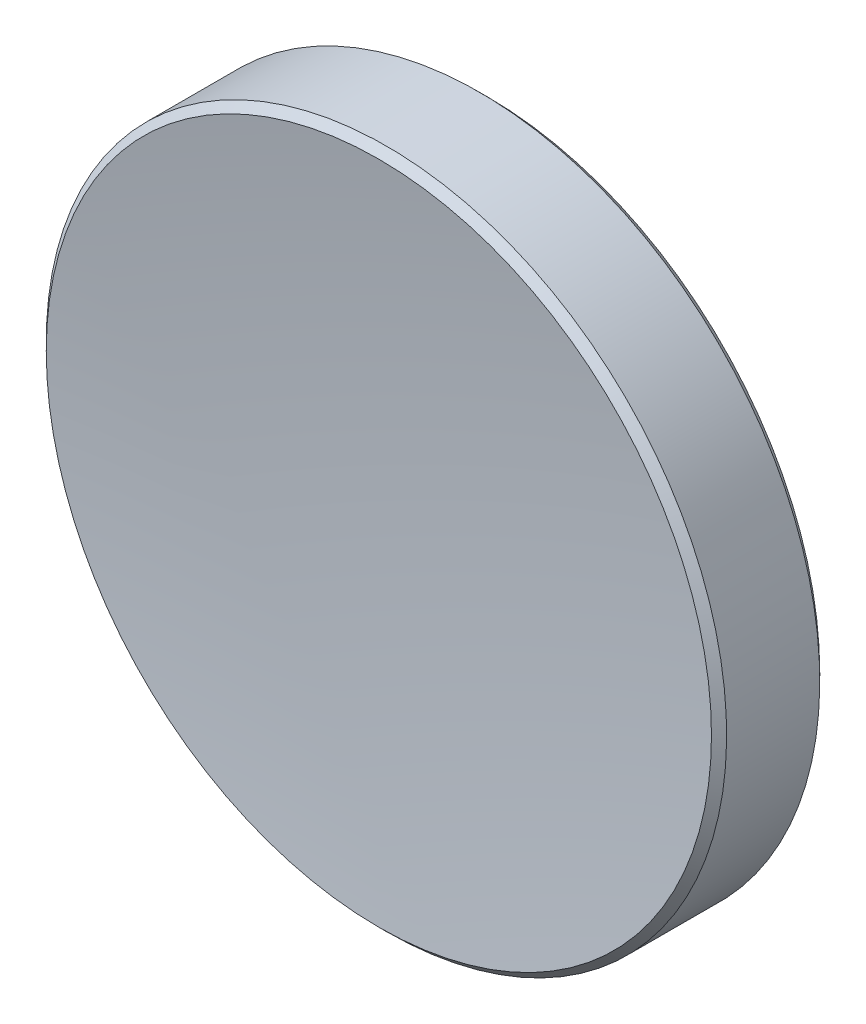
ISO-10303-21;
HEADER;
FILE_DESCRIPTION(('STEP AP214'),'2;1');
FILE_NAME('part.step','',(''),(''),'','','');
FILE_SCHEMA(('AUTOMOTIVE_DESIGN { 1 0 10303 214 1 1 1 1 }'));
ENDSEC;
DATA;
#1=APPLICATION_CONTEXT('core data for automotive mechanical design processes');
#2=APPLICATION_PROTOCOL_DEFINITION('international standard','automotive_design',2000,#1);
#3=PRODUCT_CONTEXT('',#1,'mechanical');
#4=PRODUCT('Part','Part','',(#3));
#5=PRODUCT_RELATED_PRODUCT_CATEGORY('part','',(#4));
#6=PRODUCT_DEFINITION_FORMATION('','',#4);
#7=PRODUCT_DEFINITION_CONTEXT('part definition',#1,'design');
#8=PRODUCT_DEFINITION('design','',#6,#7);
#9=PRODUCT_DEFINITION_SHAPE('','',#8);
#10=(LENGTH_UNIT() NAMED_UNIT(*) SI_UNIT(.MILLI.,.METRE.));
#11=(NAMED_UNIT(*) PLANE_ANGLE_UNIT() SI_UNIT($,.RADIAN.));
#12=(NAMED_UNIT(*) SI_UNIT($,.STERADIAN.) SOLID_ANGLE_UNIT());
#13=UNCERTAINTY_MEASURE_WITH_UNIT(LENGTH_MEASURE(1.E-05),#10,'distance_accuracy_value','');
#14=(GEOMETRIC_REPRESENTATION_CONTEXT(3) GLOBAL_UNCERTAINTY_ASSIGNED_CONTEXT((#13)) GLOBAL_UNIT_ASSIGNED_CONTEXT((#10,
#11,#12)) REPRESENTATION_CONTEXT('',''));
#15=CARTESIAN_POINT('',(0.,0.,0.));
#16=DIRECTION('',(0.,0.,1.));
#17=DIRECTION('',(1.,0.,0.));
#18=AXIS2_PLACEMENT_3D('',#15,#16,#17);
#19=CARTESIAN_POINT('',(0.,0.,54.0943324852001));
#20=DIRECTION('',(0.,0.,1.));
#21=DIRECTION('',(0.,1.,0.));
#22=AXIS2_PLACEMENT_3D('',#19,#20,#21);
#23=SPHERICAL_SURFACE('',#22,52.786);
#24=CARTESIAN_POINT('',(0.,0.,1.67472406216609));
#25=DIRECTION('',(0.,0.,1.));
#26=DIRECTION('',(0.,-1.,0.));
#27=AXIS2_PLACEMENT_3D('',#24,#25,#26);
#28=CIRCLE('',#27,6.20857864376269);
#29=CARTESIAN_POINT('',(0.,-6.20857864376269,1.67472406216608));
#30=VERTEX_POINT('',#29);
#31=EDGE_CURVE('E27',#30,#30,#28,.T.);
#32=ORIENTED_EDGE('',*,*,#31,.T.);
#33=EDGE_LOOP('',(#32));
#34=FACE_BOUND('',#33,.T.);
#35=ADVANCED_FACE('F13',(#34),#23,.F.);
#36=CARTESIAN_POINT('',(0.,0.,13.3083324852001));
#37=DIRECTION('',(0.,0.,1.));
#38=DIRECTION('',(0.,-1.,0.));
#39=AXIS2_PLACEMENT_3D('',#36,#37,#38);
#40=SPHERICAL_SURFACE('',#39,15.);
#41=CARTESIAN_POINT('',(0.,0.,-0.346467082139389));
#42=DIRECTION('',(0.,0.,1.));
#43=DIRECTION('',(0.,-1.,0.));
#44=AXIS2_PLACEMENT_3D('',#41,#42,#43);
#45=CIRCLE('',#44,6.20857864376269);
#46=CARTESIAN_POINT('',(0.,-6.20857864376269,-0.34646708213939));
#47=VERTEX_POINT('',#46);
#48=EDGE_CURVE('E9',#47,#47,#45,.T.);
#49=ORIENTED_EDGE('',*,*,#48,.F.);
#50=EDGE_LOOP('',(#49));
#51=FACE_BOUND('',#50,.T.);
#52=ADVANCED_FACE('F48',(#51),#40,.T.);
#53=CARTESIAN_POINT('',(0.,0.,-0.346467082139389));
#54=DIRECTION('',(0.,0.,1.));
#55=DIRECTION('',(0.,-1.,0.));
#56=AXIS2_PLACEMENT_3D('',#53,#54,#55);
#57=CONICAL_SURFACE('',#56,6.20857864376269,0.785398163397448);
#58=CARTESIAN_POINT('',(0.,0.,-0.205045725902081));
#59=DIRECTION('',(0.,0.,1.));
#60=DIRECTION('',(0.,-1.,0.));
#61=AXIS2_PLACEMENT_3D('',#58,#59,#60);
#62=CIRCLE('',#61,6.35);
#63=CARTESIAN_POINT('',(0.,-6.35,-0.205045725902082));
#64=VERTEX_POINT('',#63);
#65=EDGE_CURVE('E19',#64,#64,#62,.T.);
#66=ORIENTED_EDGE('',*,*,#65,.F.);
#67=EDGE_LOOP('',(#66));
#68=FACE_BOUND('',#67,.T.);
#69=ORIENTED_EDGE('',*,*,#48,.T.);
#70=EDGE_LOOP('',(#69));
#71=FACE_BOUND('',#70,.T.);
#72=ADVANCED_FACE('F42',(#68,#71),#57,.T.);
#73=CARTESIAN_POINT('',(0.,0.,1.30833248520007));
#74=DIRECTION('',(0.,0.,1.));
#75=DIRECTION('',(0.,-1.,0.));
#76=AXIS2_PLACEMENT_3D('',#73,#74,#75);
#77=CYLINDRICAL_SURFACE('',#76,6.35);
#78=CARTESIAN_POINT('',(0.,0.,1.53330270592878));
#79=DIRECTION('',(0.,0.,1.));
#80=DIRECTION('',(0.,-1.,0.));
#81=AXIS2_PLACEMENT_3D('',#78,#79,#80);
#82=CIRCLE('',#81,6.35);
#83=CARTESIAN_POINT('',(0.,-6.35,1.53330270592878));
#84=VERTEX_POINT('',#83);
#85=EDGE_CURVE('E23',#84,#84,#82,.T.);
#86=ORIENTED_EDGE('',*,*,#85,.F.);
#87=EDGE_LOOP('',(#86));
#88=FACE_BOUND('',#87,.T.);
#89=ORIENTED_EDGE('',*,*,#65,.T.);
#90=EDGE_LOOP('',(#89));
#91=FACE_BOUND('',#90,.T.);
#92=ADVANCED_FACE('F37',(#88,#91),#77,.T.);
#93=CARTESIAN_POINT('',(0.,0.,1.53330270592878));
#94=DIRECTION('',(0.,0.,-1.));
#95=DIRECTION('',(0.,1.,0.));
#96=AXIS2_PLACEMENT_3D('',#93,#94,#95);
#97=CONICAL_SURFACE('',#96,6.35,0.785398163397454);
#98=ORIENTED_EDGE('',*,*,#31,.F.);
#99=EDGE_LOOP('',(#98));
#100=FACE_BOUND('',#99,.T.);
#101=ORIENTED_EDGE('',*,*,#85,.T.);
#102=EDGE_LOOP('',(#101));
#103=FACE_BOUND('',#102,.T.);
#104=ADVANCED_FACE('F34',(#100,#103),#97,.T.);
#105=CLOSED_SHELL('',(#35,#52,#72,#92,#104));
#106=MANIFOLD_SOLID_BREP('B1',#105);
#107=ADVANCED_BREP_SHAPE_REPRESENTATION('',(#18,#106),#14);
#108=SHAPE_DEFINITION_REPRESENTATION(#9,#107);
ENDSEC;
END-ISO-10303-21;
